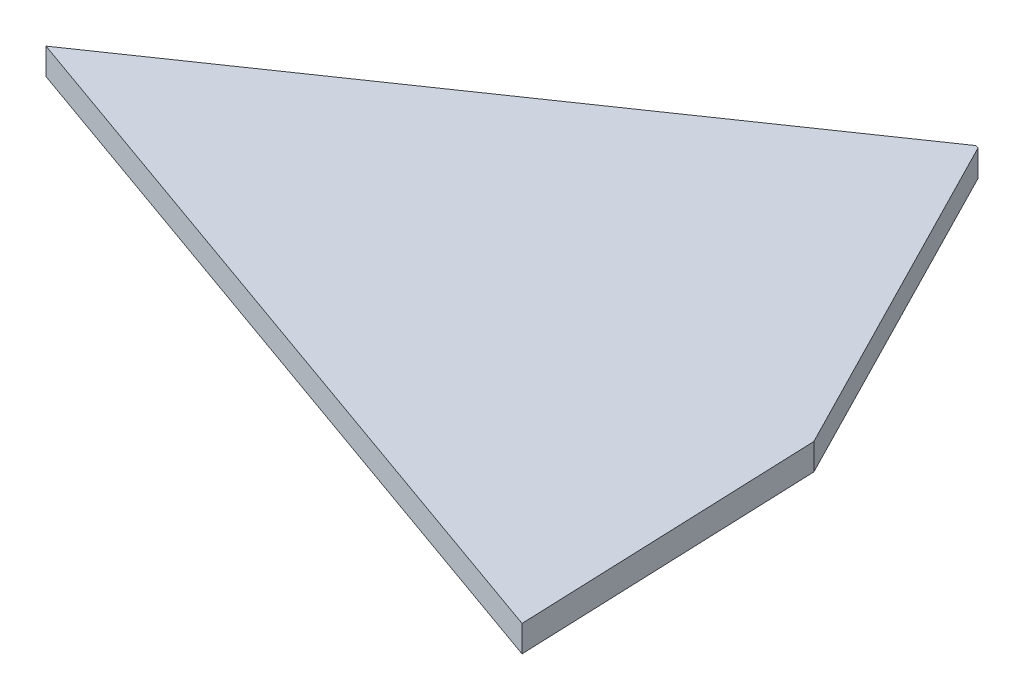
ISO-10303-21;
HEADER;
FILE_DESCRIPTION(('STEP AP214'),'2;1');
FILE_NAME('part.step','',(''),(''),'','','');
FILE_SCHEMA(('AUTOMOTIVE_DESIGN { 1 0 10303 214 1 1 1 1 }'));
ENDSEC;
DATA;
#1=APPLICATION_CONTEXT('core data for automotive mechanical design processes');
#2=APPLICATION_PROTOCOL_DEFINITION('international standard','automotive_design',2000,#1);
#3=PRODUCT_CONTEXT('',#1,'mechanical');
#4=PRODUCT('Part','Part','',(#3));
#5=PRODUCT_RELATED_PRODUCT_CATEGORY('part','',(#4));
#6=PRODUCT_DEFINITION_FORMATION('','',#4);
#7=PRODUCT_DEFINITION_CONTEXT('part definition',#1,'design');
#8=PRODUCT_DEFINITION('design','',#6,#7);
#9=PRODUCT_DEFINITION_SHAPE('','',#8);
#10=(LENGTH_UNIT() NAMED_UNIT(*) SI_UNIT(.MILLI.,.METRE.));
#11=(NAMED_UNIT(*) PLANE_ANGLE_UNIT() SI_UNIT($,.RADIAN.));
#12=(NAMED_UNIT(*) SI_UNIT($,.STERADIAN.) SOLID_ANGLE_UNIT());
#13=UNCERTAINTY_MEASURE_WITH_UNIT(LENGTH_MEASURE(1.E-05),#10,'distance_accuracy_value','');
#14=(GEOMETRIC_REPRESENTATION_CONTEXT(3) GLOBAL_UNCERTAINTY_ASSIGNED_CONTEXT((#13)) GLOBAL_UNIT_ASSIGNED_CONTEXT((#10,
#11,#12)) REPRESENTATION_CONTEXT('',''));
#15=CARTESIAN_POINT('',(0.,0.,0.));
#16=DIRECTION('',(0.,0.,1.));
#17=DIRECTION('',(1.,0.,0.));
#18=AXIS2_PLACEMENT_3D('',#15,#16,#17);
#19=CARTESIAN_POINT('',(41.9925526204077,2.,-28.6220025313289));
#20=DIRECTION('',(-0.334501929858701,0.,0.942395065203975));
#21=DIRECTION('',(0.942395065203975,0.,0.334501929858701));
#22=AXIS2_PLACEMENT_3D('',#19,#20,#21);
#23=PLANE('',#22);
#24=DIRECTION('',(-0.942395065203975,0.,-0.334501929858701));
#25=VECTOR('',#24,1.);
#26=CARTESIAN_POINT('',(41.9925526204077,0.,-28.6220025313289));
#27=LINE('',#26,#25);
#28=CARTESIAN_POINT('',(41.9925526204077,0.,-28.6220025313289));
#29=VERTEX_POINT('',#28);
#30=CARTESIAN_POINT('',(41.7609833544264,0.,-28.7041977477798));
#31=VERTEX_POINT('',#30);
#32=EDGE_CURVE('E118',#29,#31,#27,.T.);
#33=ORIENTED_EDGE('',*,*,#32,.T.);
#34=DIRECTION('',(0.,-1.,0.));
#35=VECTOR('',#34,1.);
#36=CARTESIAN_POINT('',(41.7609833544264,2.,-28.7041977477798));
#37=LINE('',#36,#35);
#38=CARTESIAN_POINT('',(41.7609833544264,2.,-28.7041977477798));
#39=VERTEX_POINT('',#38);
#40=EDGE_CURVE('E11',#39,#31,#37,.T.);
#41=ORIENTED_EDGE('',*,*,#40,.F.);
#42=DIRECTION('',(-0.942395065203975,0.,-0.334501929858701));
#43=VECTOR('',#42,1.);
#44=CARTESIAN_POINT('',(41.9925526204077,2.,-28.6220025313289));
#45=LINE('',#44,#43);
#46=CARTESIAN_POINT('',(41.9925526204077,2.,-28.6220025313289));
#47=VERTEX_POINT('',#46);
#48=EDGE_CURVE('E131',#47,#39,#45,.T.);
#49=ORIENTED_EDGE('',*,*,#48,.F.);
#50=DIRECTION('',(0.,-1.,0.));
#51=VECTOR('',#50,1.);
#52=CARTESIAN_POINT('',(41.9925526204077,2.,-28.6220025313289));
#53=LINE('',#52,#51);
#54=EDGE_CURVE('E114',#47,#29,#53,.T.);
#55=ORIENTED_EDGE('',*,*,#54,.T.);
#56=EDGE_LOOP('',(#33,#41,#49,#55));
#57=FACE_BOUND('',#56,.T.);
#58=ADVANCED_FACE('F39',(#57),#23,.F.);
#59=CARTESIAN_POINT('',(41.7609833544264,2.,-28.7041977477798));
#60=DIRECTION('',(0.566442009639778,0.,0.82410160157304));
#61=DIRECTION('',(0.82410160157304,0.,-0.566442009639778));
#62=AXIS2_PLACEMENT_3D('',#59,#60,#61);
#63=PLANE('',#62);
#64=DIRECTION('',(-0.82410160157304,0.,0.566442009639777));
#65=VECTOR('',#64,1.);
#66=CARTESIAN_POINT('',(41.7609833544264,0.,-28.7041977477798));
#67=LINE('',#66,#65);
#68=CARTESIAN_POINT('',(0.,0.,0.));
#69=VERTEX_POINT('',#68);
#70=EDGE_CURVE('E122',#31,#69,#67,.T.);
#71=ORIENTED_EDGE('',*,*,#70,.T.);
#72=DIRECTION('',(0.,-1.,0.));
#73=VECTOR('',#72,1.);
#74=CARTESIAN_POINT('',(0.,2.,0.));
#75=LINE('',#74,#73);
#76=CARTESIAN_POINT('',(0.,2.,0.));
#77=VERTEX_POINT('',#76);
#78=EDGE_CURVE('E48',#77,#69,#75,.T.);
#79=ORIENTED_EDGE('',*,*,#78,.F.);
#80=DIRECTION('',(-0.82410160157304,0.,0.566442009639777));
#81=VECTOR('',#80,1.);
#82=CARTESIAN_POINT('',(41.7609833544264,2.,-28.7041977477798));
#83=LINE('',#82,#81);
#84=EDGE_CURVE('E90',#39,#77,#83,.T.);
#85=ORIENTED_EDGE('',*,*,#84,.F.);
#86=ORIENTED_EDGE('',*,*,#40,.T.);
#87=EDGE_LOOP('',(#71,#79,#85,#86));
#88=FACE_BOUND('',#87,.T.);
#89=ADVANCED_FACE('F153',(#88),#63,.F.);
#90=CARTESIAN_POINT('',(0.,2.,0.));
#91=DIRECTION('',(0.334501929857404,0.,-0.942395065204436));
#92=DIRECTION('',(-0.942395065204436,0.,-0.334501929857404));
#93=AXIS2_PLACEMENT_3D('',#90,#91,#92);
#94=PLANE('',#93);
#95=DIRECTION('',(0.942395065204436,0.,0.334501929857404));
#96=VECTOR('',#95,1.);
#97=CARTESIAN_POINT('',(0.,0.,0.));
#98=LINE('',#97,#96);
#99=CARTESIAN_POINT('',(55.9163044761393,0.,19.8474211595169));
#100=VERTEX_POINT('',#99);
#101=EDGE_CURVE('E106',#69,#100,#98,.T.);
#102=ORIENTED_EDGE('',*,*,#101,.T.);
#103=DIRECTION('',(0.,-1.,0.));
#104=VECTOR('',#103,1.);
#105=CARTESIAN_POINT('',(55.9163044761393,2.,19.8474211595169));
#106=LINE('',#105,#104);
#107=CARTESIAN_POINT('',(55.9163044761393,2.,19.8474211595169));
#108=VERTEX_POINT('',#107);
#109=EDGE_CURVE('E103',#108,#100,#106,.T.);
#110=ORIENTED_EDGE('',*,*,#109,.F.);
#111=DIRECTION('',(0.942395065204436,0.,0.334501929857404));
#112=VECTOR('',#111,1.);
#113=CARTESIAN_POINT('',(0.,2.,0.));
#114=LINE('',#113,#112);
#115=EDGE_CURVE('E94',#77,#108,#114,.T.);
#116=ORIENTED_EDGE('',*,*,#115,.F.);
#117=ORIENTED_EDGE('',*,*,#78,.T.);
#118=EDGE_LOOP('',(#102,#110,#116,#117));
#119=FACE_BOUND('',#118,.T.);
#120=ADVANCED_FACE('F104',(#119),#94,.F.);
#121=CARTESIAN_POINT('',(55.9163044761393,2.,19.8474211595169));
#122=DIRECTION('',(-0.999259223756197,0.,0.0384838113778158));
#123=DIRECTION('',(0.0384838113778158,0.,0.999259223756197));
#124=AXIS2_PLACEMENT_3D('',#121,#122,#123);
#125=PLANE('',#124);
#126=DIRECTION('',(-0.0384838113778158,0.,-0.999259223756197));
#127=VECTOR('',#126,1.);
#128=CARTESIAN_POINT('',(55.9163044761393,0.,19.8474211595169));
#129=LINE('',#128,#127);
#130=CARTESIAN_POINT('',(55.0307526778807,0.,-3.14655399113251));
#131=VERTEX_POINT('',#130);
#132=EDGE_CURVE('E76',#100,#131,#129,.T.);
#133=ORIENTED_EDGE('',*,*,#132,.T.);
#134=DIRECTION('',(0.,-1.,0.));
#135=VECTOR('',#134,1.);
#136=CARTESIAN_POINT('',(55.0307526778807,2.,-3.14655399113251));
#137=LINE('',#136,#135);
#138=CARTESIAN_POINT('',(55.0307526778807,2.,-3.14655399113251));
#139=VERTEX_POINT('',#138);
#140=EDGE_CURVE('E108',#139,#131,#137,.T.);
#141=ORIENTED_EDGE('',*,*,#140,.F.);
#142=DIRECTION('',(-0.0384838113778158,0.,-0.999259223756197));
#143=VECTOR('',#142,1.);
#144=CARTESIAN_POINT('',(55.9163044761393,2.,19.8474211595169));
#145=LINE('',#144,#143);
#146=EDGE_CURVE('E98',#108,#139,#145,.T.);
#147=ORIENTED_EDGE('',*,*,#146,.F.);
#148=ORIENTED_EDGE('',*,*,#109,.T.);
#149=EDGE_LOOP('',(#133,#141,#147,#148));
#150=FACE_BOUND('',#149,.T.);
#151=ADVANCED_FACE('F110',(#150),#125,.F.);
#152=CARTESIAN_POINT('',(55.0307526778807,2.,-3.14655399113251));
#153=DIRECTION('',(-0.890187942433877,0.,0.455593488918948));
#154=DIRECTION('',(0.455593488918948,0.,0.890187942433877));
#155=AXIS2_PLACEMENT_3D('',#152,#153,#154);
#156=PLANE('',#155);
#157=DIRECTION('',(-0.455593488918948,0.,-0.890187942433877));
#158=VECTOR('',#157,1.);
#159=CARTESIAN_POINT('',(55.0307526778807,0.,-3.14655399113251));
#160=LINE('',#159,#158);
#161=EDGE_CURVE('E82',#131,#29,#160,.T.);
#162=ORIENTED_EDGE('',*,*,#161,.T.);
#163=ORIENTED_EDGE('',*,*,#54,.F.);
#164=DIRECTION('',(-0.455593488918948,0.,-0.890187942433877));
#165=VECTOR('',#164,1.);
#166=CARTESIAN_POINT('',(55.0307526778807,2.,-3.14655399113251));
#167=LINE('',#166,#165);
#168=EDGE_CURVE('E56',#139,#47,#167,.T.);
#169=ORIENTED_EDGE('',*,*,#168,.F.);
#170=ORIENTED_EDGE('',*,*,#140,.T.);
#171=EDGE_LOOP('',(#162,#163,#169,#170));
#172=FACE_BOUND('',#171,.T.);
#173=ADVANCED_FACE('F142',(#172),#156,.F.);
#174=CARTESIAN_POINT('',(0.,2.,0.));
#175=DIRECTION('',(0.,-1.,0.));
#176=DIRECTION('',(0.,0.,-1.));
#177=AXIS2_PLACEMENT_3D('',#174,#175,#176);
#178=PLANE('',#177);
#179=ORIENTED_EDGE('',*,*,#48,.T.);
#180=ORIENTED_EDGE('',*,*,#84,.T.);
#181=ORIENTED_EDGE('',*,*,#115,.T.);
#182=ORIENTED_EDGE('',*,*,#146,.T.);
#183=ORIENTED_EDGE('',*,*,#168,.T.);
#184=EDGE_LOOP('',(#179,#180,#181,#182,#183));
#185=FACE_BOUND('',#184,.T.);
#186=ADVANCED_FACE('F96',(#185),#178,.F.);
#187=CARTESIAN_POINT('',(0.,0.,0.));
#188=DIRECTION('',(0.,-1.,0.));
#189=DIRECTION('',(0.,0.,-1.));
#190=AXIS2_PLACEMENT_3D('',#187,#188,#189);
#191=PLANE('',#190);
#192=ORIENTED_EDGE('',*,*,#32,.F.);
#193=ORIENTED_EDGE('',*,*,#161,.F.);
#194=ORIENTED_EDGE('',*,*,#132,.F.);
#195=ORIENTED_EDGE('',*,*,#101,.F.);
#196=ORIENTED_EDGE('',*,*,#70,.F.);
#197=EDGE_LOOP('',(#192,#193,#194,#195,#196));
#198=FACE_BOUND('',#197,.T.);
#199=ADVANCED_FACE('F138',(#198),#191,.T.);
#200=CLOSED_SHELL('',(#58,#89,#120,#151,#173,#186,#199));
#201=MANIFOLD_SOLID_BREP('B2',#200);
#202=ADVANCED_BREP_SHAPE_REPRESENTATION('',(#18,#201),#14);
#203=SHAPE_DEFINITION_REPRESENTATION(#9,#202);
ENDSEC;
END-ISO-10303-21;
